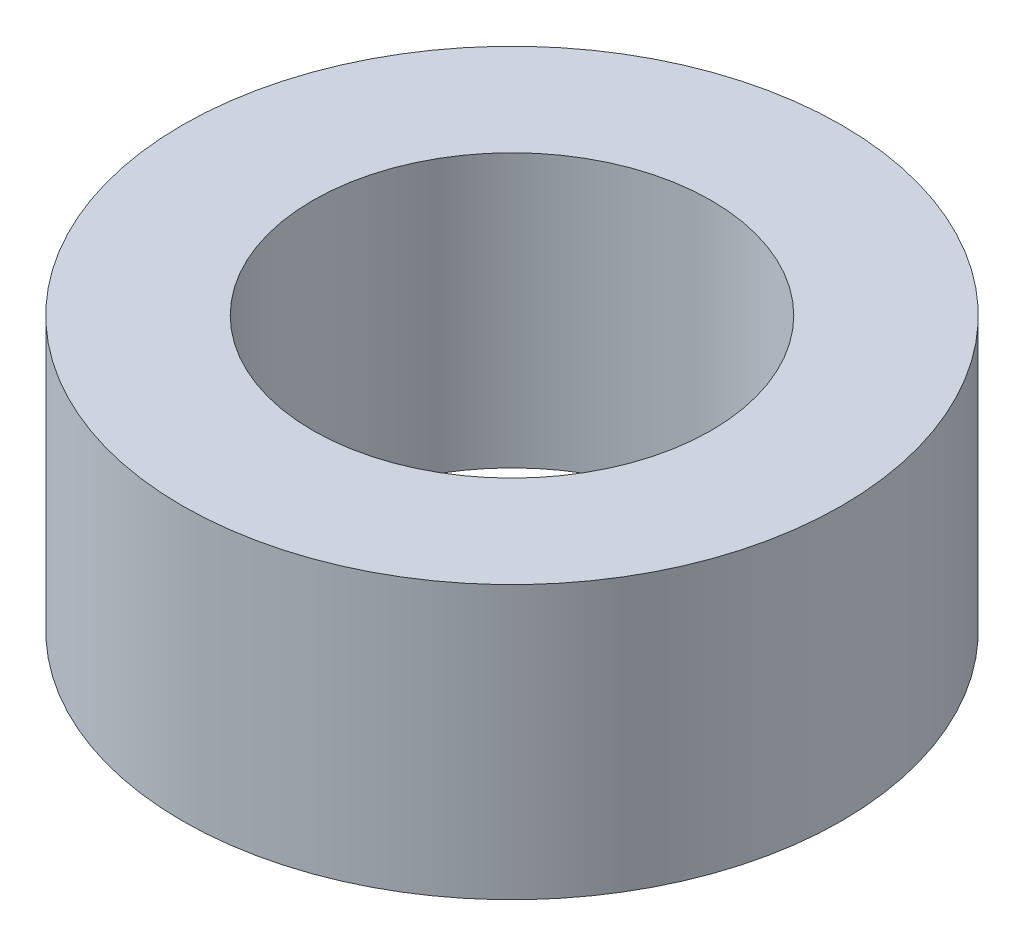
ISO-10303-21;
HEADER;
FILE_DESCRIPTION(('STEP AP214'),'2;1');
FILE_NAME('part.step','',(''),(''),'','','');
FILE_SCHEMA(('AUTOMOTIVE_DESIGN { 1 0 10303 214 1 1 1 1 }'));
ENDSEC;
DATA;
#1=APPLICATION_CONTEXT('core data for automotive mechanical design processes');
#2=APPLICATION_PROTOCOL_DEFINITION('international standard','automotive_design',2000,#1);
#3=PRODUCT_CONTEXT('',#1,'mechanical');
#4=PRODUCT('Part','Part','',(#3));
#5=PRODUCT_RELATED_PRODUCT_CATEGORY('part','',(#4));
#6=PRODUCT_DEFINITION_FORMATION('','',#4);
#7=PRODUCT_DEFINITION_CONTEXT('part definition',#1,'design');
#8=PRODUCT_DEFINITION('design','',#6,#7);
#9=PRODUCT_DEFINITION_SHAPE('','',#8);
#10=(LENGTH_UNIT() NAMED_UNIT(*) SI_UNIT(.MILLI.,.METRE.));
#11=(NAMED_UNIT(*) PLANE_ANGLE_UNIT() SI_UNIT($,.RADIAN.));
#12=(NAMED_UNIT(*) SI_UNIT($,.STERADIAN.) SOLID_ANGLE_UNIT());
#13=UNCERTAINTY_MEASURE_WITH_UNIT(LENGTH_MEASURE(1.E-05),#10,'distance_accuracy_value','');
#14=(GEOMETRIC_REPRESENTATION_CONTEXT(3) GLOBAL_UNCERTAINTY_ASSIGNED_CONTEXT((#13)) GLOBAL_UNIT_ASSIGNED_CONTEXT((#10,
#11,#12)) REPRESENTATION_CONTEXT('',''));
#15=CARTESIAN_POINT('',(0.,0.,0.));
#16=DIRECTION('',(0.,0.,1.));
#17=DIRECTION('',(1.,0.,0.));
#18=AXIS2_PLACEMENT_3D('',#15,#16,#17);
#19=CARTESIAN_POINT('',(0.,18.624368903105,0.));
#20=DIRECTION('',(0.,-1.,0.));
#21=DIRECTION('',(0.,0.,-1.));
#22=AXIS2_PLACEMENT_3D('',#19,#20,#21);
#23=CYLINDRICAL_SURFACE('',#22,22.5);
#24=CARTESIAN_POINT('',(0.,18.624368903105,0.));
#25=DIRECTION('',(0.,1.,0.));
#26=DIRECTION('',(0.,0.,1.));
#27=AXIS2_PLACEMENT_3D('',#24,#25,#26);
#28=CIRCLE('',#27,22.5);
#29=CARTESIAN_POINT('',(0.,18.624368903105,22.5));
#30=VERTEX_POINT('',#29);
#31=EDGE_CURVE('E10',#30,#30,#28,.T.);
#32=ORIENTED_EDGE('',*,*,#31,.F.);
#33=EDGE_LOOP('',(#32));
#34=FACE_BOUND('',#33,.T.);
#35=CARTESIAN_POINT('',(0.,0.,0.));
#36=DIRECTION('',(0.,1.,0.));
#37=DIRECTION('',(0.,0.,1.));
#38=AXIS2_PLACEMENT_3D('',#35,#36,#37);
#39=CIRCLE('',#38,22.5);
#40=CARTESIAN_POINT('',(0.,0.,22.5));
#41=VERTEX_POINT('',#40);
#42=EDGE_CURVE('E37',#41,#41,#39,.T.);
#43=ORIENTED_EDGE('',*,*,#42,.T.);
#44=EDGE_LOOP('',(#43));
#45=FACE_BOUND('',#44,.T.);
#46=ADVANCED_FACE('F40',(#34,#45),#23,.T.);
#47=CARTESIAN_POINT('',(0.,18.624368903105,0.));
#48=DIRECTION('',(0.,1.,0.));
#49=DIRECTION('',(0.,0.,1.));
#50=AXIS2_PLACEMENT_3D('',#47,#48,#49);
#51=PLANE('',#50);
#52=CARTESIAN_POINT('',(0.,18.624368903105,0.));
#53=DIRECTION('',(0.,1.,0.));
#54=DIRECTION('',(0.,0.,1.));
#55=AXIS2_PLACEMENT_3D('',#52,#53,#54);
#56=CIRCLE('',#55,13.5972661936879);
#57=CARTESIAN_POINT('',(0.,18.624368903105,13.5972661936879));
#58=VERTEX_POINT('',#57);
#59=EDGE_CURVE('E50',#58,#58,#56,.T.);
#60=ORIENTED_EDGE('',*,*,#59,.F.);
#61=EDGE_LOOP('',(#60));
#62=FACE_BOUND('',#61,.T.);
#63=ORIENTED_EDGE('',*,*,#31,.T.);
#64=EDGE_LOOP('',(#63));
#65=FACE_BOUND('',#64,.T.);
#66=ADVANCED_FACE('F59',(#62,#65),#51,.T.);
#67=CARTESIAN_POINT('',(0.,0.,0.));
#68=DIRECTION('',(0.,1.,0.));
#69=DIRECTION('',(0.,0.,1.));
#70=AXIS2_PLACEMENT_3D('',#67,#68,#69);
#71=PLANE('',#70);
#72=CARTESIAN_POINT('',(0.,0.,0.));
#73=DIRECTION('',(0.,1.,0.));
#74=DIRECTION('',(0.,0.,1.));
#75=AXIS2_PLACEMENT_3D('',#72,#73,#74);
#76=CIRCLE('',#75,13.5972661936879);
#77=CARTESIAN_POINT('',(0.,0.,13.5972661936879));
#78=VERTEX_POINT('',#77);
#79=EDGE_CURVE('E47',#78,#78,#76,.T.);
#80=ORIENTED_EDGE('',*,*,#79,.T.);
#81=EDGE_LOOP('',(#80));
#82=FACE_BOUND('',#81,.T.);
#83=ORIENTED_EDGE('',*,*,#42,.F.);
#84=EDGE_LOOP('',(#83));
#85=FACE_BOUND('',#84,.T.);
#86=ADVANCED_FACE('F58',(#82,#85),#71,.F.);
#87=CARTESIAN_POINT('',(0.,18.624368903105,0.));
#88=DIRECTION('',(0.,-1.,0.));
#89=DIRECTION('',(0.,0.,-1.));
#90=AXIS2_PLACEMENT_3D('',#87,#88,#89);
#91=CYLINDRICAL_SURFACE('',#90,13.5972661936879);
#92=ORIENTED_EDGE('',*,*,#59,.T.);
#93=EDGE_LOOP('',(#92));
#94=FACE_BOUND('',#93,.T.);
#95=ORIENTED_EDGE('',*,*,#79,.F.);
#96=EDGE_LOOP('',(#95));
#97=FACE_BOUND('',#96,.T.);
#98=ADVANCED_FACE('F54',(#94,#97),#91,.F.);
#99=CLOSED_SHELL('',(#46,#66,#86,#98));
#100=MANIFOLD_SOLID_BREP('B2',#99);
#101=ADVANCED_BREP_SHAPE_REPRESENTATION('',(#18,#100),#14);
#102=SHAPE_DEFINITION_REPRESENTATION(#9,#101);
ENDSEC;
END-ISO-10303-21;
